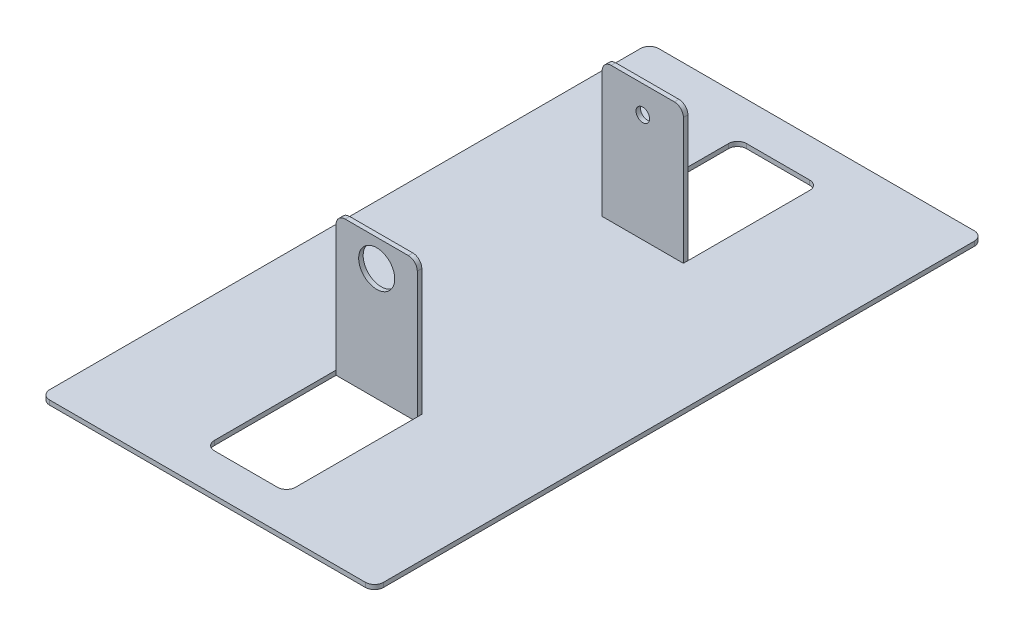
ISO-10303-21;
HEADER;
FILE_DESCRIPTION(('STEP AP214'),'2;1');
FILE_NAME('part.step','',(''),(''),'','','');
FILE_SCHEMA(('AUTOMOTIVE_DESIGN { 1 0 10303 214 1 1 1 1 }'));
ENDSEC;
DATA;
#1=APPLICATION_CONTEXT('core data for automotive mechanical design processes');
#2=APPLICATION_PROTOCOL_DEFINITION('international standard','automotive_design',2000,#1);
#3=PRODUCT_CONTEXT('',#1,'mechanical');
#4=PRODUCT('Part','Part','',(#3));
#5=PRODUCT_RELATED_PRODUCT_CATEGORY('part','',(#4));
#6=PRODUCT_DEFINITION_FORMATION('','',#4);
#7=PRODUCT_DEFINITION_CONTEXT('part definition',#1,'design');
#8=PRODUCT_DEFINITION('design','',#6,#7);
#9=PRODUCT_DEFINITION_SHAPE('','',#8);
#10=(LENGTH_UNIT() NAMED_UNIT(*) SI_UNIT(.MILLI.,.METRE.));
#11=(NAMED_UNIT(*) PLANE_ANGLE_UNIT() SI_UNIT($,.RADIAN.));
#12=(NAMED_UNIT(*) SI_UNIT($,.STERADIAN.) SOLID_ANGLE_UNIT());
#13=UNCERTAINTY_MEASURE_WITH_UNIT(LENGTH_MEASURE(1.E-05),#10,'distance_accuracy_value','');
#14=(GEOMETRIC_REPRESENTATION_CONTEXT(3) GLOBAL_UNCERTAINTY_ASSIGNED_CONTEXT((#13)) GLOBAL_UNIT_ASSIGNED_CONTEXT((#10,
#11,#12)) REPRESENTATION_CONTEXT('',''));
#15=CARTESIAN_POINT('',(0.,0.,0.));
#16=DIRECTION('',(0.,0.,1.));
#17=DIRECTION('',(1.,0.,0.));
#18=AXIS2_PLACEMENT_3D('',#15,#16,#17);
#19=CARTESIAN_POINT('',(-9.00000000000001,1.,29.));
#20=DIRECTION('',(1.,0.,0.));
#21=DIRECTION('',(0.,0.,-1.));
#22=AXIS2_PLACEMENT_3D('',#19,#20,#21);
#23=PLANE('',#22);
#24=DIRECTION('',(0.,0.,1.));
#25=VECTOR('',#24,1.);
#26=CARTESIAN_POINT('',(-9.00000000000001,1.,29.));
#27=LINE('',#26,#25);
#28=CARTESIAN_POINT('',(-9.00000000000001,1.,30.));
#29=VERTEX_POINT('',#28);
#30=CARTESIAN_POINT('',(-9.00000000000001,1.,57.));
#31=VERTEX_POINT('',#30);
#32=EDGE_CURVE('E272',#29,#31,#27,.T.);
#33=ORIENTED_EDGE('',*,*,#32,.T.);
#34=DIRECTION('',(0.,-1.,0.));
#35=VECTOR('',#34,1.);
#36=CARTESIAN_POINT('',(-9.00000000000001,0.,57.));
#37=LINE('',#36,#35);
#38=CARTESIAN_POINT('',(-9.00000000000001,0.,57.));
#39=VERTEX_POINT('',#38);
#40=EDGE_CURVE('E258',#31,#39,#37,.T.);
#41=ORIENTED_EDGE('',*,*,#40,.T.);
#42=DIRECTION('',(0.,0.,1.));
#43=VECTOR('',#42,1.);
#44=CARTESIAN_POINT('',(-9.00000000000001,0.,29.));
#45=LINE('',#44,#43);
#46=CARTESIAN_POINT('',(-9.00000000000001,0.,30.));
#47=VERTEX_POINT('',#46);
#48=EDGE_CURVE('E250',#47,#39,#45,.T.);
#49=ORIENTED_EDGE('',*,*,#48,.F.);
#50=DIRECTION('',(0.,-1.,0.));
#51=VECTOR('',#50,1.);
#52=CARTESIAN_POINT('',(-9.00000000000001,31.,30.));
#53=LINE('',#52,#51);
#54=EDGE_CURVE('E230',#29,#47,#53,.T.);
#55=ORIENTED_EDGE('',*,*,#54,.F.);
#56=EDGE_LOOP('',(#33,#41,#49,#55));
#57=FACE_BOUND('',#56,.T.);
#58=ADVANCED_FACE('F32',(#57),#23,.T.);
#59=CARTESIAN_POINT('',(8.99999999999999,1.,29.));
#60=DIRECTION('',(-1.,0.,0.));
#61=DIRECTION('',(0.,0.,1.));
#62=AXIS2_PLACEMENT_3D('',#59,#60,#61);
#63=PLANE('',#62);
#64=DIRECTION('',(0.,0.,-1.));
#65=VECTOR('',#64,1.);
#66=CARTESIAN_POINT('',(8.99999999999999,0.,29.));
#67=LINE('',#66,#65);
#68=CARTESIAN_POINT('',(8.99999999999999,0.,57.));
#69=VERTEX_POINT('',#68);
#70=CARTESIAN_POINT('',(8.99999999999999,0.,30.));
#71=VERTEX_POINT('',#70);
#72=EDGE_CURVE('E252',#69,#71,#67,.T.);
#73=ORIENTED_EDGE('',*,*,#72,.F.);
#74=DIRECTION('',(0.,-1.,0.));
#75=VECTOR('',#74,1.);
#76=CARTESIAN_POINT('',(8.99999999999999,1.,57.));
#77=LINE('',#76,#75);
#78=CARTESIAN_POINT('',(8.99999999999999,1.,57.));
#79=VERTEX_POINT('',#78);
#80=EDGE_CURVE('E320',#69,#79,#77,.F.);
#81=ORIENTED_EDGE('',*,*,#80,.T.);
#82=DIRECTION('',(0.,0.,-1.));
#83=VECTOR('',#82,1.);
#84=CARTESIAN_POINT('',(8.99999999999999,1.,29.));
#85=LINE('',#84,#83);
#86=CARTESIAN_POINT('',(8.99999999999999,1.,30.));
#87=VERTEX_POINT('',#86);
#88=EDGE_CURVE('E463',#79,#87,#85,.T.);
#89=ORIENTED_EDGE('',*,*,#88,.T.);
#90=DIRECTION('',(0.,-1.,0.));
#91=VECTOR('',#90,1.);
#92=CARTESIAN_POINT('',(8.99999999999999,31.,30.));
#93=LINE('',#92,#91);
#94=EDGE_CURVE('E882',#87,#71,#93,.T.);
#95=ORIENTED_EDGE('',*,*,#94,.T.);
#96=EDGE_LOOP('',(#73,#81,#89,#95));
#97=FACE_BOUND('',#96,.T.);
#98=ADVANCED_FACE('F534',(#97),#63,.T.);
#99=CARTESIAN_POINT('',(8.99999999999999,1.,-29.));
#100=DIRECTION('',(-1.,0.,0.));
#101=DIRECTION('',(0.,0.,1.));
#102=AXIS2_PLACEMENT_3D('',#99,#100,#101);
#103=PLANE('',#102);
#104=DIRECTION('',(0.,0.,-1.));
#105=VECTOR('',#104,1.);
#106=CARTESIAN_POINT('',(8.99999999999999,1.,-29.));
#107=LINE('',#106,#105);
#108=CARTESIAN_POINT('',(8.99999999999999,1.,-30.));
#109=VERTEX_POINT('',#108);
#110=CARTESIAN_POINT('',(8.99999999999999,1.,-57.));
#111=VERTEX_POINT('',#110);
#112=EDGE_CURVE('E277',#109,#111,#107,.T.);
#113=ORIENTED_EDGE('',*,*,#112,.T.);
#114=DIRECTION('',(0.,-1.,0.));
#115=VECTOR('',#114,1.);
#116=CARTESIAN_POINT('',(8.99999999999999,0.,-57.));
#117=LINE('',#116,#115);
#118=CARTESIAN_POINT('',(8.99999999999999,0.,-57.));
#119=VERTEX_POINT('',#118);
#120=EDGE_CURVE('E358',#111,#119,#117,.T.);
#121=ORIENTED_EDGE('',*,*,#120,.T.);
#122=DIRECTION('',(0.,0.,-1.));
#123=VECTOR('',#122,1.);
#124=CARTESIAN_POINT('',(8.99999999999999,0.,-29.));
#125=LINE('',#124,#123);
#126=CARTESIAN_POINT('',(8.99999999999999,0.,-30.));
#127=VERTEX_POINT('',#126);
#128=EDGE_CURVE('E286',#127,#119,#125,.T.);
#129=ORIENTED_EDGE('',*,*,#128,.F.);
#130=DIRECTION('',(0.,-1.,0.));
#131=VECTOR('',#130,1.);
#132=CARTESIAN_POINT('',(8.99999999999999,31.,-30.));
#133=LINE('',#132,#131);
#134=EDGE_CURVE('E447',#109,#127,#133,.T.);
#135=ORIENTED_EDGE('',*,*,#134,.F.);
#136=EDGE_LOOP('',(#113,#121,#129,#135));
#137=FACE_BOUND('',#136,.T.);
#138=ADVANCED_FACE('F445',(#137),#103,.T.);
#139=CARTESIAN_POINT('',(-9.00000000000001,1.,-29.));
#140=DIRECTION('',(1.,0.,0.));
#141=DIRECTION('',(0.,0.,-1.));
#142=AXIS2_PLACEMENT_3D('',#139,#140,#141);
#143=PLANE('',#142);
#144=DIRECTION('',(0.,0.,1.));
#145=VECTOR('',#144,1.);
#146=CARTESIAN_POINT('',(-9.00000000000001,0.,-29.));
#147=LINE('',#146,#145);
#148=CARTESIAN_POINT('',(-9.00000000000001,0.,-57.));
#149=VERTEX_POINT('',#148);
#150=CARTESIAN_POINT('',(-9.00000000000001,0.,-30.));
#151=VERTEX_POINT('',#150);
#152=EDGE_CURVE('E292',#149,#151,#147,.T.);
#153=ORIENTED_EDGE('',*,*,#152,.F.);
#154=DIRECTION('',(0.,-1.,0.));
#155=VECTOR('',#154,1.);
#156=CARTESIAN_POINT('',(-9.00000000000001,1.,-57.));
#157=LINE('',#156,#155);
#158=CARTESIAN_POINT('',(-9.00000000000001,1.,-57.));
#159=VERTEX_POINT('',#158);
#160=EDGE_CURVE('E366',#149,#159,#157,.F.);
#161=ORIENTED_EDGE('',*,*,#160,.T.);
#162=DIRECTION('',(0.,0.,1.));
#163=VECTOR('',#162,1.);
#164=CARTESIAN_POINT('',(-9.00000000000001,1.,-29.));
#165=LINE('',#164,#163);
#166=CARTESIAN_POINT('',(-9.00000000000001,1.,-30.));
#167=VERTEX_POINT('',#166);
#168=EDGE_CURVE('E280',#159,#167,#165,.T.);
#169=ORIENTED_EDGE('',*,*,#168,.T.);
#170=DIRECTION('',(0.,-1.,0.));
#171=VECTOR('',#170,1.);
#172=CARTESIAN_POINT('',(-9.00000000000001,31.,-30.));
#173=LINE('',#172,#171);
#174=EDGE_CURVE('E426',#167,#151,#173,.T.);
#175=ORIENTED_EDGE('',*,*,#174,.T.);
#176=EDGE_LOOP('',(#153,#161,#169,#175));
#177=FACE_BOUND('',#176,.T.);
#178=ADVANCED_FACE('F423',(#177),#143,.T.);
#179=CARTESIAN_POINT('',(0.,1.,0.));
#180=DIRECTION('',(0.,-1.,0.));
#181=DIRECTION('',(0.,0.,-1.));
#182=AXIS2_PLACEMENT_3D('',#179,#180,#181);
#183=PLANE('',#182);
#184=CARTESIAN_POINT('',(8.99999999999999,1.,-29.));
#185=VERTEX_POINT('',#184);
#186=EDGE_CURVE('E273',#185,#109,#107,.T.);
#187=ORIENTED_EDGE('',*,*,#186,.F.);
#188=DIRECTION('',(1.,0.,0.));
#189=VECTOR('',#188,1.);
#190=CARTESIAN_POINT('',(-9.00000000000001,1.,-29.));
#191=LINE('',#190,#189);
#192=CARTESIAN_POINT('',(-9.00000000000001,1.,-29.));
#193=VERTEX_POINT('',#192);
#194=EDGE_CURVE('E282',#193,#185,#191,.T.);
#195=ORIENTED_EDGE('',*,*,#194,.F.);
#196=DIRECTION('',(0.,0.,1.));
#197=VECTOR('',#196,1.);
#198=CARTESIAN_POINT('',(-9.00000000000001,1.,0.));
#199=LINE('',#198,#197);
#200=EDGE_CURVE('E260',#167,#193,#199,.T.);
#201=ORIENTED_EDGE('',*,*,#200,.F.);
#202=ORIENTED_EDGE('',*,*,#168,.F.);
#203=CARTESIAN_POINT('',(-7.00000000000001,1.,-57.));
#204=DIRECTION('',(0.,-1.,0.));
#205=DIRECTION('',(0.,0.,-1.));
#206=AXIS2_PLACEMENT_3D('',#203,#204,#205);
#207=CIRCLE('',#206,2.);
#208=CARTESIAN_POINT('',(-7.00000000000001,1.,-59.));
#209=VERTEX_POINT('',#208);
#210=EDGE_CURVE('E11',#159,#209,#207,.T.);
#211=ORIENTED_EDGE('',*,*,#210,.T.);
#212=DIRECTION('',(-1.,0.,0.));
#213=VECTOR('',#212,1.);
#214=CARTESIAN_POINT('',(-9.00000000000001,1.,-59.));
#215=LINE('',#214,#213);
#216=CARTESIAN_POINT('',(6.99999999999999,1.,-59.));
#217=VERTEX_POINT('',#216);
#218=EDGE_CURVE('E276',#217,#209,#215,.T.);
#219=ORIENTED_EDGE('',*,*,#218,.F.);
#220=CARTESIAN_POINT('',(6.99999999999999,1.,-57.));
#221=DIRECTION('',(0.,-1.,0.));
#222=DIRECTION('',(0.,0.,-1.));
#223=AXIS2_PLACEMENT_3D('',#220,#221,#222);
#224=CIRCLE('',#223,2.);
#225=EDGE_CURVE('E412',#217,#111,#224,.T.);
#226=ORIENTED_EDGE('',*,*,#225,.T.);
#227=ORIENTED_EDGE('',*,*,#112,.F.);
#228=EDGE_LOOP('',(#187,#195,#201,#202,#211,#219,#226,#227));
#229=FACE_BOUND('',#228,.T.);
#230=DIRECTION('',(-1.,0.,0.));
#231=VECTOR('',#230,1.);
#232=CARTESIAN_POINT('',(-37.,1.,-67.5));
#233=LINE('',#232,#231);
#234=CARTESIAN_POINT('',(35.,1.,-67.5));
#235=VERTEX_POINT('',#234);
#236=CARTESIAN_POINT('',(-35.,1.,-67.5));
#237=VERTEX_POINT('',#236);
#238=EDGE_CURVE('E297',#235,#237,#233,.T.);
#239=ORIENTED_EDGE('',*,*,#238,.T.);
#240=CARTESIAN_POINT('',(-35.,1.,-65.5));
#241=DIRECTION('',(0.,-1.,0.));
#242=DIRECTION('',(0.,0.,-1.));
#243=AXIS2_PLACEMENT_3D('',#240,#241,#242);
#244=CIRCLE('',#243,2.);
#245=CARTESIAN_POINT('',(-37.,1.,-65.5));
#246=VERTEX_POINT('',#245);
#247=EDGE_CURVE('E391',#237,#246,#244,.F.);
#248=ORIENTED_EDGE('',*,*,#247,.T.);
#249=DIRECTION('',(0.,0.,1.));
#250=VECTOR('',#249,1.);
#251=CARTESIAN_POINT('',(-37.,1.,67.5));
#252=LINE('',#251,#250);
#253=CARTESIAN_POINT('',(-37.,1.,65.5));
#254=VERTEX_POINT('',#253);
#255=EDGE_CURVE('E301',#246,#254,#252,.T.);
#256=ORIENTED_EDGE('',*,*,#255,.T.);
#257=CARTESIAN_POINT('',(-35.,1.,65.5));
#258=DIRECTION('',(0.,-1.,0.));
#259=DIRECTION('',(0.,0.,-1.));
#260=AXIS2_PLACEMENT_3D('',#257,#258,#259);
#261=CIRCLE('',#260,2.);
#262=CARTESIAN_POINT('',(-35.,1.,67.5));
#263=VERTEX_POINT('',#262);
#264=EDGE_CURVE('E54',#254,#263,#261,.F.);
#265=ORIENTED_EDGE('',*,*,#264,.T.);
#266=DIRECTION('',(1.,0.,0.));
#267=VECTOR('',#266,1.);
#268=CARTESIAN_POINT('',(-37.,1.,67.5));
#269=LINE('',#268,#267);
#270=CARTESIAN_POINT('',(35.,1.,67.5));
#271=VERTEX_POINT('',#270);
#272=EDGE_CURVE('E303',#263,#271,#269,.T.);
#273=ORIENTED_EDGE('',*,*,#272,.T.);
#274=CARTESIAN_POINT('',(35.,1.,65.5));
#275=DIRECTION('',(0.,-1.,0.));
#276=DIRECTION('',(0.,0.,-1.));
#277=AXIS2_PLACEMENT_3D('',#274,#275,#276);
#278=CIRCLE('',#277,2.);
#279=CARTESIAN_POINT('',(37.,1.,65.5));
#280=VERTEX_POINT('',#279);
#281=EDGE_CURVE('E387',#271,#280,#278,.F.);
#282=ORIENTED_EDGE('',*,*,#281,.T.);
#283=DIRECTION('',(0.,0.,-1.));
#284=VECTOR('',#283,1.);
#285=CARTESIAN_POINT('',(37.,1.,67.5));
#286=LINE('',#285,#284);
#287=CARTESIAN_POINT('',(37.,1.,-65.5));
#288=VERTEX_POINT('',#287);
#289=EDGE_CURVE('E294',#280,#288,#286,.T.);
#290=ORIENTED_EDGE('',*,*,#289,.T.);
#291=CARTESIAN_POINT('',(35.,1.,-65.5));
#292=DIRECTION('',(0.,-1.,0.));
#293=DIRECTION('',(0.,0.,-1.));
#294=AXIS2_PLACEMENT_3D('',#291,#292,#293);
#295=CIRCLE('',#294,2.);
#296=EDGE_CURVE('E389',#288,#235,#295,.F.);
#297=ORIENTED_EDGE('',*,*,#296,.T.);
#298=EDGE_LOOP('',(#239,#248,#256,#265,#273,#282,#290,#297));
#299=FACE_BOUND('',#298,.T.);
#300=CARTESIAN_POINT('',(-9.00000000000001,1.,29.));
#301=VERTEX_POINT('',#300);
#302=EDGE_CURVE('E459',#301,#29,#27,.T.);
#303=ORIENTED_EDGE('',*,*,#302,.F.);
#304=DIRECTION('',(-1.,0.,0.));
#305=VECTOR('',#304,1.);
#306=CARTESIAN_POINT('',(-9.00000000000001,1.,29.));
#307=LINE('',#306,#305);
#308=CARTESIAN_POINT('',(8.99999999999999,1.,29.));
#309=VERTEX_POINT('',#308);
#310=EDGE_CURVE('E268',#309,#301,#307,.T.);
#311=ORIENTED_EDGE('',*,*,#310,.F.);
#312=DIRECTION('',(0.,0.,-1.));
#313=VECTOR('',#312,1.);
#314=CARTESIAN_POINT('',(8.99999999999999,1.,0.));
#315=LINE('',#314,#313);
#316=EDGE_CURVE('E483',#87,#309,#315,.T.);
#317=ORIENTED_EDGE('',*,*,#316,.F.);
#318=ORIENTED_EDGE('',*,*,#88,.F.);
#319=CARTESIAN_POINT('',(6.99999999999999,1.,57.));
#320=DIRECTION('',(0.,-1.,0.));
#321=DIRECTION('',(0.,0.,-1.));
#322=AXIS2_PLACEMENT_3D('',#319,#320,#321);
#323=CIRCLE('',#322,2.);
#324=CARTESIAN_POINT('',(6.99999999999999,1.,59.));
#325=VERTEX_POINT('',#324);
#326=EDGE_CURVE('E408',#79,#325,#323,.T.);
#327=ORIENTED_EDGE('',*,*,#326,.T.);
#328=DIRECTION('',(1.,0.,0.));
#329=VECTOR('',#328,1.);
#330=CARTESIAN_POINT('',(-9.00000000000001,1.,59.));
#331=LINE('',#330,#329);
#332=CARTESIAN_POINT('',(-7.00000000000001,1.,59.));
#333=VERTEX_POINT('',#332);
#334=EDGE_CURVE('E461',#333,#325,#331,.T.);
#335=ORIENTED_EDGE('',*,*,#334,.F.);
#336=CARTESIAN_POINT('',(-7.00000000000001,1.,57.));
#337=DIRECTION('',(0.,-1.,0.));
#338=DIRECTION('',(0.,0.,-1.));
#339=AXIS2_PLACEMENT_3D('',#336,#337,#338);
#340=CIRCLE('',#339,2.);
#341=EDGE_CURVE('E404',#333,#31,#340,.T.);
#342=ORIENTED_EDGE('',*,*,#341,.T.);
#343=ORIENTED_EDGE('',*,*,#32,.F.);
#344=EDGE_LOOP('',(#303,#311,#317,#318,#327,#335,#342,#343));
#345=FACE_BOUND('',#344,.T.);
#346=ADVANCED_FACE('F432',(#229,#299,#345),#183,.F.);
#347=CARTESIAN_POINT('',(0.,0.,0.));
#348=DIRECTION('',(0.,-1.,0.));
#349=DIRECTION('',(0.,0.,-1.));
#350=AXIS2_PLACEMENT_3D('',#347,#348,#349);
#351=PLANE('',#350);
#352=DIRECTION('',(1.,0.,0.));
#353=VECTOR('',#352,1.);
#354=CARTESIAN_POINT('',(-9.00000000000001,0.,30.));
#355=LINE('',#354,#353);
#356=EDGE_CURVE('E235',#47,#71,#355,.T.);
#357=ORIENTED_EDGE('',*,*,#356,.F.);
#358=ORIENTED_EDGE('',*,*,#48,.T.);
#359=CARTESIAN_POINT('',(-7.00000000000001,0.,57.));
#360=DIRECTION('',(0.,-1.,0.));
#361=DIRECTION('',(0.,0.,-1.));
#362=AXIS2_PLACEMENT_3D('',#359,#360,#361);
#363=CIRCLE('',#362,2.);
#364=CARTESIAN_POINT('',(-7.00000000000001,0.,59.));
#365=VERTEX_POINT('',#364);
#366=EDGE_CURVE('E402',#39,#365,#363,.F.);
#367=ORIENTED_EDGE('',*,*,#366,.T.);
#368=DIRECTION('',(1.,0.,0.));
#369=VECTOR('',#368,1.);
#370=CARTESIAN_POINT('',(-9.00000000000001,0.,59.));
#371=LINE('',#370,#369);
#372=CARTESIAN_POINT('',(6.99999999999999,0.,59.));
#373=VERTEX_POINT('',#372);
#374=EDGE_CURVE('E259',#365,#373,#371,.T.);
#375=ORIENTED_EDGE('',*,*,#374,.T.);
#376=CARTESIAN_POINT('',(6.99999999999999,0.,57.));
#377=DIRECTION('',(0.,-1.,0.));
#378=DIRECTION('',(0.,0.,-1.));
#379=AXIS2_PLACEMENT_3D('',#376,#377,#378);
#380=CIRCLE('',#379,2.);
#381=EDGE_CURVE('E406',#373,#69,#380,.F.);
#382=ORIENTED_EDGE('',*,*,#381,.T.);
#383=ORIENTED_EDGE('',*,*,#72,.T.);
#384=EDGE_LOOP('',(#357,#358,#367,#375,#382,#383));
#385=FACE_BOUND('',#384,.T.);
#386=DIRECTION('',(-1.,0.,0.));
#387=VECTOR('',#386,1.);
#388=CARTESIAN_POINT('',(-9.00000000000001,0.,-30.));
#389=LINE('',#388,#387);
#390=EDGE_CURVE('E485',#127,#151,#389,.T.);
#391=ORIENTED_EDGE('',*,*,#390,.F.);
#392=ORIENTED_EDGE('',*,*,#128,.T.);
#393=CARTESIAN_POINT('',(6.99999999999999,0.,-57.));
#394=DIRECTION('',(0.,-1.,0.));
#395=DIRECTION('',(0.,0.,-1.));
#396=AXIS2_PLACEMENT_3D('',#393,#394,#395);
#397=CIRCLE('',#396,2.);
#398=CARTESIAN_POINT('',(6.99999999999999,0.,-59.));
#399=VERTEX_POINT('',#398);
#400=EDGE_CURVE('E410',#119,#399,#397,.F.);
#401=ORIENTED_EDGE('',*,*,#400,.T.);
#402=DIRECTION('',(-1.,0.,0.));
#403=VECTOR('',#402,1.);
#404=CARTESIAN_POINT('',(-9.00000000000001,0.,-59.));
#405=LINE('',#404,#403);
#406=CARTESIAN_POINT('',(-7.00000000000001,0.,-59.));
#407=VERTEX_POINT('',#406);
#408=EDGE_CURVE('E289',#399,#407,#405,.T.);
#409=ORIENTED_EDGE('',*,*,#408,.T.);
#410=CARTESIAN_POINT('',(-7.00000000000001,0.,-57.));
#411=DIRECTION('',(0.,-1.,0.));
#412=DIRECTION('',(0.,0.,-1.));
#413=AXIS2_PLACEMENT_3D('',#410,#411,#412);
#414=CIRCLE('',#413,2.);
#415=EDGE_CURVE('E40',#407,#149,#414,.F.);
#416=ORIENTED_EDGE('',*,*,#415,.T.);
#417=ORIENTED_EDGE('',*,*,#152,.T.);
#418=EDGE_LOOP('',(#391,#392,#401,#409,#416,#417));
#419=FACE_BOUND('',#418,.T.);
#420=DIRECTION('',(0.,0.,1.));
#421=VECTOR('',#420,1.);
#422=CARTESIAN_POINT('',(-37.,0.,67.5));
#423=LINE('',#422,#421);
#424=CARTESIAN_POINT('',(-37.,0.,-65.5));
#425=VERTEX_POINT('',#424);
#426=CARTESIAN_POINT('',(-37.,0.,65.5));
#427=VERTEX_POINT('',#426);
#428=EDGE_CURVE('E310',#425,#427,#423,.T.);
#429=ORIENTED_EDGE('',*,*,#428,.F.);
#430=CARTESIAN_POINT('',(-35.,0.,-65.5));
#431=DIRECTION('',(0.,-1.,0.));
#432=DIRECTION('',(0.,0.,-1.));
#433=AXIS2_PLACEMENT_3D('',#430,#431,#432);
#434=CIRCLE('',#433,2.);
#435=CARTESIAN_POINT('',(-35.,0.,-67.5));
#436=VERTEX_POINT('',#435);
#437=EDGE_CURVE('E379',#425,#436,#434,.T.);
#438=ORIENTED_EDGE('',*,*,#437,.T.);
#439=DIRECTION('',(-1.,0.,0.));
#440=VECTOR('',#439,1.);
#441=CARTESIAN_POINT('',(-37.,0.,-67.5));
#442=LINE('',#441,#440);
#443=CARTESIAN_POINT('',(35.,0.,-67.5));
#444=VERTEX_POINT('',#443);
#445=EDGE_CURVE('E307',#444,#436,#442,.T.);
#446=ORIENTED_EDGE('',*,*,#445,.F.);
#447=CARTESIAN_POINT('',(35.,0.,-65.5));
#448=DIRECTION('',(0.,-1.,0.));
#449=DIRECTION('',(0.,0.,-1.));
#450=AXIS2_PLACEMENT_3D('',#447,#448,#449);
#451=CIRCLE('',#450,2.);
#452=CARTESIAN_POINT('',(37.,0.,-65.5));
#453=VERTEX_POINT('',#452);
#454=EDGE_CURVE('E377',#444,#453,#451,.T.);
#455=ORIENTED_EDGE('',*,*,#454,.T.);
#456=DIRECTION('',(0.,0.,-1.));
#457=VECTOR('',#456,1.);
#458=CARTESIAN_POINT('',(37.,0.,67.5));
#459=LINE('',#458,#457);
#460=CARTESIAN_POINT('',(37.,0.,65.5));
#461=VERTEX_POINT('',#460);
#462=EDGE_CURVE('E285',#461,#453,#459,.T.);
#463=ORIENTED_EDGE('',*,*,#462,.F.);
#464=CARTESIAN_POINT('',(35.,0.,65.5));
#465=DIRECTION('',(0.,-1.,0.));
#466=DIRECTION('',(0.,0.,-1.));
#467=AXIS2_PLACEMENT_3D('',#464,#465,#466);
#468=CIRCLE('',#467,2.);
#469=CARTESIAN_POINT('',(35.,0.,67.5));
#470=VERTEX_POINT('',#469);
#471=EDGE_CURVE('E375',#461,#470,#468,.T.);
#472=ORIENTED_EDGE('',*,*,#471,.T.);
#473=DIRECTION('',(1.,0.,0.));
#474=VECTOR('',#473,1.);
#475=CARTESIAN_POINT('',(-37.,0.,67.5));
#476=LINE('',#475,#474);
#477=CARTESIAN_POINT('',(-35.,0.,67.5));
#478=VERTEX_POINT('',#477);
#479=EDGE_CURVE('E298',#478,#470,#476,.T.);
#480=ORIENTED_EDGE('',*,*,#479,.F.);
#481=CARTESIAN_POINT('',(-35.,0.,65.5));
#482=DIRECTION('',(0.,-1.,0.));
#483=DIRECTION('',(0.,0.,-1.));
#484=AXIS2_PLACEMENT_3D('',#481,#482,#483);
#485=CIRCLE('',#484,2.);
#486=EDGE_CURVE('E373',#478,#427,#485,.T.);
#487=ORIENTED_EDGE('',*,*,#486,.T.);
#488=EDGE_LOOP('',(#429,#438,#446,#455,#463,#472,#480,#487));
#489=FACE_BOUND('',#488,.T.);
#490=ADVANCED_FACE('F248',(#385,#419,#489),#351,.T.);
#491=CARTESIAN_POINT('',(37.,1.,67.5));
#492=DIRECTION('',(-1.,0.,0.));
#493=DIRECTION('',(0.,0.,1.));
#494=AXIS2_PLACEMENT_3D('',#491,#492,#493);
#495=PLANE('',#494);
#496=ORIENTED_EDGE('',*,*,#462,.T.);
#497=DIRECTION('',(0.,-1.,0.));
#498=VECTOR('',#497,1.);
#499=CARTESIAN_POINT('',(37.,1.,-65.5));
#500=LINE('',#499,#498);
#501=EDGE_CURVE('E396',#453,#288,#500,.F.);
#502=ORIENTED_EDGE('',*,*,#501,.T.);
#503=ORIENTED_EDGE('',*,*,#289,.F.);
#504=DIRECTION('',(0.,-1.,0.));
#505=VECTOR('',#504,1.);
#506=CARTESIAN_POINT('',(37.,1.,65.5));
#507=LINE('',#506,#505);
#508=EDGE_CURVE('E393',#280,#461,#507,.T.);
#509=ORIENTED_EDGE('',*,*,#508,.T.);
#510=EDGE_LOOP('',(#496,#502,#503,#509));
#511=FACE_BOUND('',#510,.T.);
#512=ADVANCED_FACE('F552',(#511),#495,.F.);
#513=CARTESIAN_POINT('',(-37.,1.,-67.5));
#514=DIRECTION('',(0.,0.,1.));
#515=DIRECTION('',(1.,0.,0.));
#516=AXIS2_PLACEMENT_3D('',#513,#514,#515);
#517=PLANE('',#516);
#518=ORIENTED_EDGE('',*,*,#445,.T.);
#519=DIRECTION('',(0.,-1.,0.));
#520=VECTOR('',#519,1.);
#521=CARTESIAN_POINT('',(-35.,1.,-67.5));
#522=LINE('',#521,#520);
#523=EDGE_CURVE('E384',#436,#237,#522,.F.);
#524=ORIENTED_EDGE('',*,*,#523,.T.);
#525=ORIENTED_EDGE('',*,*,#238,.F.);
#526=DIRECTION('',(0.,-1.,0.));
#527=VECTOR('',#526,1.);
#528=CARTESIAN_POINT('',(35.,1.,-67.5));
#529=LINE('',#528,#527);
#530=EDGE_CURVE('E381',#235,#444,#529,.T.);
#531=ORIENTED_EDGE('',*,*,#530,.T.);
#532=EDGE_LOOP('',(#518,#524,#525,#531));
#533=FACE_BOUND('',#532,.T.);
#534=ADVANCED_FACE('F558',(#533),#517,.F.);
#535=CARTESIAN_POINT('',(-37.,1.,67.5));
#536=DIRECTION('',(1.,0.,0.));
#537=DIRECTION('',(0.,0.,-1.));
#538=AXIS2_PLACEMENT_3D('',#535,#536,#537);
#539=PLANE('',#538);
#540=ORIENTED_EDGE('',*,*,#255,.F.);
#541=DIRECTION('',(0.,-1.,0.));
#542=VECTOR('',#541,1.);
#543=CARTESIAN_POINT('',(-37.,1.,-65.5));
#544=LINE('',#543,#542);
#545=EDGE_CURVE('E370',#246,#425,#544,.T.);
#546=ORIENTED_EDGE('',*,*,#545,.T.);
#547=ORIENTED_EDGE('',*,*,#428,.T.);
#548=DIRECTION('',(0.,-1.,0.));
#549=VECTOR('',#548,1.);
#550=CARTESIAN_POINT('',(-37.,1.,65.5));
#551=LINE('',#550,#549);
#552=EDGE_CURVE('E368',#427,#254,#551,.F.);
#553=ORIENTED_EDGE('',*,*,#552,.T.);
#554=EDGE_LOOP('',(#540,#546,#547,#553));
#555=FACE_BOUND('',#554,.T.);
#556=ADVANCED_FACE('F555',(#555),#539,.F.);
#557=CARTESIAN_POINT('',(-37.,1.,67.5));
#558=DIRECTION('',(0.,0.,-1.));
#559=DIRECTION('',(-1.,0.,0.));
#560=AXIS2_PLACEMENT_3D('',#557,#558,#559);
#561=PLANE('',#560);
#562=ORIENTED_EDGE('',*,*,#479,.T.);
#563=DIRECTION('',(0.,-1.,0.));
#564=VECTOR('',#563,1.);
#565=CARTESIAN_POINT('',(35.,1.,67.5));
#566=LINE('',#565,#564);
#567=EDGE_CURVE('E47',#470,#271,#566,.F.);
#568=ORIENTED_EDGE('',*,*,#567,.T.);
#569=ORIENTED_EDGE('',*,*,#272,.F.);
#570=DIRECTION('',(0.,-1.,0.));
#571=VECTOR('',#570,1.);
#572=CARTESIAN_POINT('',(-35.,1.,67.5));
#573=LINE('',#572,#571);
#574=EDGE_CURVE('E398',#263,#478,#573,.T.);
#575=ORIENTED_EDGE('',*,*,#574,.T.);
#576=EDGE_LOOP('',(#562,#568,#569,#575));
#577=FACE_BOUND('',#576,.T.);
#578=ADVANCED_FACE('F545',(#577),#561,.F.);
#579=CARTESIAN_POINT('',(-9.00000000000001,1.,-59.));
#580=DIRECTION('',(0.,0.,1.));
#581=DIRECTION('',(1.,0.,0.));
#582=AXIS2_PLACEMENT_3D('',#579,#580,#581);
#583=PLANE('',#582);
#584=ORIENTED_EDGE('',*,*,#408,.F.);
#585=DIRECTION('',(0.,-1.,0.));
#586=VECTOR('',#585,1.);
#587=CARTESIAN_POINT('',(6.99999999999999,1.,-59.));
#588=LINE('',#587,#586);
#589=EDGE_CURVE('E364',#399,#217,#588,.F.);
#590=ORIENTED_EDGE('',*,*,#589,.T.);
#591=ORIENTED_EDGE('',*,*,#218,.T.);
#592=DIRECTION('',(0.,-1.,0.));
#593=VECTOR('',#592,1.);
#594=CARTESIAN_POINT('',(-7.00000000000001,0.,-59.));
#595=LINE('',#594,#593);
#596=EDGE_CURVE('E361',#209,#407,#595,.T.);
#597=ORIENTED_EDGE('',*,*,#596,.T.);
#598=EDGE_LOOP('',(#584,#590,#591,#597));
#599=FACE_BOUND('',#598,.T.);
#600=ADVANCED_FACE('F436',(#599),#583,.T.);
#601=CARTESIAN_POINT('',(-9.00000000000001,1.,59.));
#602=DIRECTION('',(0.,0.,-1.));
#603=DIRECTION('',(-1.,0.,0.));
#604=AXIS2_PLACEMENT_3D('',#601,#602,#603);
#605=PLANE('',#604);
#606=ORIENTED_EDGE('',*,*,#374,.F.);
#607=DIRECTION('',(0.,-1.,0.));
#608=VECTOR('',#607,1.);
#609=CARTESIAN_POINT('',(-7.00000000000001,1.,59.));
#610=LINE('',#609,#608);
#611=EDGE_CURVE('E318',#365,#333,#610,.F.);
#612=ORIENTED_EDGE('',*,*,#611,.T.);
#613=ORIENTED_EDGE('',*,*,#334,.T.);
#614=DIRECTION('',(0.,-1.,0.));
#615=VECTOR('',#614,1.);
#616=CARTESIAN_POINT('',(6.99999999999999,0.,59.));
#617=LINE('',#616,#615);
#618=EDGE_CURVE('E315',#325,#373,#617,.T.);
#619=ORIENTED_EDGE('',*,*,#618,.T.);
#620=EDGE_LOOP('',(#606,#612,#613,#619));
#621=FACE_BOUND('',#620,.T.);
#622=ADVANCED_FACE('F521',(#621),#605,.T.);
#623=CARTESIAN_POINT('',(-9.00000000000001,31.,-29.));
#624=DIRECTION('',(0.,0.,-1.));
#625=DIRECTION('',(-1.,0.,0.));
#626=AXIS2_PLACEMENT_3D('',#623,#624,#625);
#627=PLANE('',#626);
#628=CARTESIAN_POINT('',(0.,25.,-29.));
#629=DIRECTION('',(0.,0.,1.));
#630=DIRECTION('',(1.,0.,0.));
#631=AXIS2_PLACEMENT_3D('',#628,#629,#630);
#632=CIRCLE('',#631,1.5);
#633=CARTESIAN_POINT('',(1.5,25.,-29.));
#634=VERTEX_POINT('',#633);
#635=EDGE_CURVE('E873',#634,#634,#632,.T.);
#636=ORIENTED_EDGE('',*,*,#635,.F.);
#637=EDGE_LOOP('',(#636));
#638=FACE_BOUND('',#637,.T.);
#639=DIRECTION('',(0.,-1.,0.));
#640=VECTOR('',#639,1.);
#641=CARTESIAN_POINT('',(8.99999999999999,31.,-29.));
#642=LINE('',#641,#640);
#643=CARTESIAN_POINT('',(8.99999999999999,29.,-29.));
#644=VERTEX_POINT('',#643);
#645=EDGE_CURVE('E452',#644,#185,#642,.T.);
#646=ORIENTED_EDGE('',*,*,#645,.F.);
#647=CARTESIAN_POINT('',(6.99999999999999,29.,-29.));
#648=DIRECTION('',(0.,0.,-1.));
#649=DIRECTION('',(-1.,0.,0.));
#650=AXIS2_PLACEMENT_3D('',#647,#648,#649);
#651=CIRCLE('',#650,2.);
#652=CARTESIAN_POINT('',(6.99999999999999,31.,-29.));
#653=VERTEX_POINT('',#652);
#654=EDGE_CURVE('E354',#644,#653,#651,.F.);
#655=ORIENTED_EDGE('',*,*,#654,.T.);
#656=DIRECTION('',(1.,0.,0.));
#657=VECTOR('',#656,1.);
#658=CARTESIAN_POINT('',(-9.00000000000001,31.,-29.));
#659=LINE('',#658,#657);
#660=CARTESIAN_POINT('',(-7.00000000000001,31.,-29.));
#661=VERTEX_POINT('',#660);
#662=EDGE_CURVE('E489',#661,#653,#659,.T.);
#663=ORIENTED_EDGE('',*,*,#662,.F.);
#664=CARTESIAN_POINT('',(-7.00000000000001,29.,-29.));
#665=DIRECTION('',(0.,0.,-1.));
#666=DIRECTION('',(-1.,0.,0.));
#667=AXIS2_PLACEMENT_3D('',#664,#665,#666);
#668=CIRCLE('',#667,2.);
#669=CARTESIAN_POINT('',(-9.00000000000001,29.,-29.));
#670=VERTEX_POINT('',#669);
#671=EDGE_CURVE('E352',#661,#670,#668,.F.);
#672=ORIENTED_EDGE('',*,*,#671,.T.);
#673=DIRECTION('',(0.,-1.,0.));
#674=VECTOR('',#673,1.);
#675=CARTESIAN_POINT('',(-9.00000000000001,31.,-29.));
#676=LINE('',#675,#674);
#677=EDGE_CURVE('E265',#670,#193,#676,.T.);
#678=ORIENTED_EDGE('',*,*,#677,.T.);
#679=ORIENTED_EDGE('',*,*,#194,.T.);
#680=EDGE_LOOP('',(#646,#655,#663,#672,#678,#679));
#681=FACE_BOUND('',#680,.T.);
#682=ADVANCED_FACE('F519',(#638,#681),#627,.F.);
#683=CARTESIAN_POINT('',(-9.00000000000001,31.,-29.));
#684=DIRECTION('',(1.,0.,0.));
#685=DIRECTION('',(0.,0.,-1.));
#686=AXIS2_PLACEMENT_3D('',#683,#684,#685);
#687=PLANE('',#686);
#688=ORIENTED_EDGE('',*,*,#677,.F.);
#689=DIRECTION('',(0.,0.,1.));
#690=VECTOR('',#689,1.);
#691=CARTESIAN_POINT('',(-9.00000000000001,29.,-29.));
#692=LINE('',#691,#690);
#693=CARTESIAN_POINT('',(-9.00000000000001,29.,-30.));
#694=VERTEX_POINT('',#693);
#695=EDGE_CURVE('E356',#670,#694,#692,.F.);
#696=ORIENTED_EDGE('',*,*,#695,.T.);
#697=EDGE_CURVE('E450',#694,#167,#173,.T.);
#698=ORIENTED_EDGE('',*,*,#697,.T.);
#699=ORIENTED_EDGE('',*,*,#200,.T.);
#700=EDGE_LOOP('',(#688,#696,#698,#699));
#701=FACE_BOUND('',#700,.T.);
#702=ADVANCED_FACE('F501',(#701),#687,.F.);
#703=CARTESIAN_POINT('',(8.99999999999999,31.,-29.));
#704=DIRECTION('',(-1.,0.,0.));
#705=DIRECTION('',(0.,0.,1.));
#706=AXIS2_PLACEMENT_3D('',#703,#704,#705);
#707=PLANE('',#706);
#708=CARTESIAN_POINT('',(8.99999999999999,29.,-30.));
#709=VERTEX_POINT('',#708);
#710=EDGE_CURVE('E449',#709,#109,#133,.T.);
#711=ORIENTED_EDGE('',*,*,#710,.F.);
#712=DIRECTION('',(0.,0.,-1.));
#713=VECTOR('',#712,1.);
#714=CARTESIAN_POINT('',(8.99999999999999,29.,-29.));
#715=LINE('',#714,#713);
#716=EDGE_CURVE('E350',#709,#644,#715,.F.);
#717=ORIENTED_EDGE('',*,*,#716,.T.);
#718=ORIENTED_EDGE('',*,*,#645,.T.);
#719=ORIENTED_EDGE('',*,*,#186,.T.);
#720=EDGE_LOOP('',(#711,#717,#718,#719));
#721=FACE_BOUND('',#720,.T.);
#722=ADVANCED_FACE('F516',(#721),#707,.F.);
#723=CARTESIAN_POINT('',(-9.00000000000001,31.,-30.));
#724=DIRECTION('',(0.,0.,1.));
#725=DIRECTION('',(1.,0.,0.));
#726=AXIS2_PLACEMENT_3D('',#723,#724,#725);
#727=PLANE('',#726);
#728=CARTESIAN_POINT('',(0.,25.,-30.));
#729=DIRECTION('',(0.,0.,1.));
#730=DIRECTION('',(1.,0.,0.));
#731=AXIS2_PLACEMENT_3D('',#728,#729,#730);
#732=CIRCLE('',#731,1.5);
#733=CARTESIAN_POINT('',(1.5,25.,-30.));
#734=VERTEX_POINT('',#733);
#735=EDGE_CURVE('E869',#734,#734,#732,.F.);
#736=ORIENTED_EDGE('',*,*,#735,.F.);
#737=EDGE_LOOP('',(#736));
#738=FACE_BOUND('',#737,.T.);
#739=DIRECTION('',(-1.,0.,0.));
#740=VECTOR('',#739,1.);
#741=CARTESIAN_POINT('',(-9.00000000000001,31.,-30.));
#742=LINE('',#741,#740);
#743=CARTESIAN_POINT('',(6.99999999999999,31.,-30.));
#744=VERTEX_POINT('',#743);
#745=CARTESIAN_POINT('',(-7.00000000000001,31.,-30.));
#746=VERTEX_POINT('',#745);
#747=EDGE_CURVE('E492',#744,#746,#742,.T.);
#748=ORIENTED_EDGE('',*,*,#747,.F.);
#749=CARTESIAN_POINT('',(6.99999999999999,29.,-30.));
#750=DIRECTION('',(0.,0.,1.));
#751=DIRECTION('',(1.,0.,0.));
#752=AXIS2_PLACEMENT_3D('',#749,#750,#751);
#753=CIRCLE('',#752,2.);
#754=EDGE_CURVE('E348',#744,#709,#753,.F.);
#755=ORIENTED_EDGE('',*,*,#754,.T.);
#756=ORIENTED_EDGE('',*,*,#710,.T.);
#757=ORIENTED_EDGE('',*,*,#134,.T.);
#758=ORIENTED_EDGE('',*,*,#390,.T.);
#759=ORIENTED_EDGE('',*,*,#174,.F.);
#760=ORIENTED_EDGE('',*,*,#697,.F.);
#761=CARTESIAN_POINT('',(-7.00000000000001,29.,-30.));
#762=DIRECTION('',(0.,0.,1.));
#763=DIRECTION('',(1.,0.,0.));
#764=AXIS2_PLACEMENT_3D('',#761,#762,#763);
#765=CIRCLE('',#764,2.);
#766=EDGE_CURVE('E346',#694,#746,#765,.F.);
#767=ORIENTED_EDGE('',*,*,#766,.T.);
#768=EDGE_LOOP('',(#748,#755,#756,#757,#758,#759,#760,#767));
#769=FACE_BOUND('',#768,.T.);
#770=ADVANCED_FACE('F495',(#738,#769),#727,.F.);
#771=CARTESIAN_POINT('',(0.,31.,0.));
#772=DIRECTION('',(0.,-1.,0.));
#773=DIRECTION('',(0.,0.,-1.));
#774=AXIS2_PLACEMENT_3D('',#771,#772,#773);
#775=PLANE('',#774);
#776=ORIENTED_EDGE('',*,*,#662,.T.);
#777=DIRECTION('',(0.,0.,-1.));
#778=VECTOR('',#777,1.);
#779=CARTESIAN_POINT('',(6.99999999999999,31.,0.));
#780=LINE('',#779,#778);
#781=EDGE_CURVE('E343',#653,#744,#780,.T.);
#782=ORIENTED_EDGE('',*,*,#781,.T.);
#783=ORIENTED_EDGE('',*,*,#747,.T.);
#784=DIRECTION('',(0.,0.,1.));
#785=VECTOR('',#784,1.);
#786=CARTESIAN_POINT('',(-7.00000000000001,31.,0.));
#787=LINE('',#786,#785);
#788=EDGE_CURVE('E340',#746,#661,#787,.T.);
#789=ORIENTED_EDGE('',*,*,#788,.T.);
#790=EDGE_LOOP('',(#776,#782,#783,#789));
#791=FACE_BOUND('',#790,.T.);
#792=ADVANCED_FACE('F507',(#791),#775,.F.);
#793=CARTESIAN_POINT('',(-9.00000000000001,31.,29.));
#794=DIRECTION('',(0.,0.,1.));
#795=DIRECTION('',(1.,0.,0.));
#796=AXIS2_PLACEMENT_3D('',#793,#794,#795);
#797=PLANE('',#796);
#798=CARTESIAN_POINT('',(0.,25.,29.));
#799=DIRECTION('',(0.,0.,1.));
#800=DIRECTION('',(1.,0.,0.));
#801=AXIS2_PLACEMENT_3D('',#798,#799,#800);
#802=CIRCLE('',#801,4.);
#803=CARTESIAN_POINT('',(4.,25.,29.));
#804=VERTEX_POINT('',#803);
#805=EDGE_CURVE('E868',#804,#804,#802,.F.);
#806=ORIENTED_EDGE('',*,*,#805,.F.);
#807=EDGE_LOOP('',(#806));
#808=FACE_BOUND('',#807,.T.);
#809=DIRECTION('',(0.,-1.,0.));
#810=VECTOR('',#809,1.);
#811=CARTESIAN_POINT('',(-9.00000000000001,31.,29.));
#812=LINE('',#811,#810);
#813=CARTESIAN_POINT('',(-9.00000000000001,29.,29.));
#814=VERTEX_POINT('',#813);
#815=EDGE_CURVE('E473',#814,#301,#812,.T.);
#816=ORIENTED_EDGE('',*,*,#815,.F.);
#817=CARTESIAN_POINT('',(-7.00000000000001,29.,29.));
#818=DIRECTION('',(0.,0.,1.));
#819=DIRECTION('',(1.,0.,0.));
#820=AXIS2_PLACEMENT_3D('',#817,#818,#819);
#821=CIRCLE('',#820,2.);
#822=CARTESIAN_POINT('',(-7.00000000000001,31.,29.));
#823=VERTEX_POINT('',#822);
#824=EDGE_CURVE('E336',#814,#823,#821,.F.);
#825=ORIENTED_EDGE('',*,*,#824,.T.);
#826=DIRECTION('',(-1.,0.,0.));
#827=VECTOR('',#826,1.);
#828=CARTESIAN_POINT('',(-9.00000000000001,31.,29.));
#829=LINE('',#828,#827);
#830=CARTESIAN_POINT('',(6.99999999999999,31.,29.));
#831=VERTEX_POINT('',#830);
#832=EDGE_CURVE('E253',#831,#823,#829,.T.);
#833=ORIENTED_EDGE('',*,*,#832,.F.);
#834=CARTESIAN_POINT('',(6.99999999999999,29.,29.));
#835=DIRECTION('',(0.,0.,1.));
#836=DIRECTION('',(1.,0.,0.));
#837=AXIS2_PLACEMENT_3D('',#834,#835,#836);
#838=CIRCLE('',#837,2.);
#839=CARTESIAN_POINT('',(8.99999999999999,29.,29.));
#840=VERTEX_POINT('',#839);
#841=EDGE_CURVE('E334',#831,#840,#838,.F.);
#842=ORIENTED_EDGE('',*,*,#841,.T.);
#843=DIRECTION('',(0.,-1.,0.));
#844=VECTOR('',#843,1.);
#845=CARTESIAN_POINT('',(8.99999999999999,31.,29.));
#846=LINE('',#845,#844);
#847=EDGE_CURVE('E476',#840,#309,#846,.T.);
#848=ORIENTED_EDGE('',*,*,#847,.T.);
#849=ORIENTED_EDGE('',*,*,#310,.T.);
#850=EDGE_LOOP('',(#816,#825,#833,#842,#848,#849));
#851=FACE_BOUND('',#850,.T.);
#852=ADVANCED_FACE('F472',(#808,#851),#797,.F.);
#853=CARTESIAN_POINT('',(-9.00000000000001,31.,29.));
#854=DIRECTION('',(1.,0.,0.));
#855=DIRECTION('',(0.,0.,-1.));
#856=AXIS2_PLACEMENT_3D('',#853,#854,#855);
#857=PLANE('',#856);
#858=CARTESIAN_POINT('',(-9.00000000000001,29.,30.));
#859=VERTEX_POINT('',#858);
#860=EDGE_CURVE('E238',#859,#29,#53,.T.);
#861=ORIENTED_EDGE('',*,*,#860,.F.);
#862=DIRECTION('',(0.,0.,1.));
#863=VECTOR('',#862,1.);
#864=CARTESIAN_POINT('',(-9.00000000000001,29.,29.));
#865=LINE('',#864,#863);
#866=EDGE_CURVE('E332',#859,#814,#865,.F.);
#867=ORIENTED_EDGE('',*,*,#866,.T.);
#868=ORIENTED_EDGE('',*,*,#815,.T.);
#869=ORIENTED_EDGE('',*,*,#302,.T.);
#870=EDGE_LOOP('',(#861,#867,#868,#869));
#871=FACE_BOUND('',#870,.T.);
#872=ADVANCED_FACE('F481',(#871),#857,.F.);
#873=CARTESIAN_POINT('',(8.99999999999999,31.,29.));
#874=DIRECTION('',(-1.,0.,0.));
#875=DIRECTION('',(0.,0.,1.));
#876=AXIS2_PLACEMENT_3D('',#873,#874,#875);
#877=PLANE('',#876);
#878=ORIENTED_EDGE('',*,*,#847,.F.);
#879=DIRECTION('',(0.,0.,-1.));
#880=VECTOR('',#879,1.);
#881=CARTESIAN_POINT('',(8.99999999999999,29.,29.));
#882=LINE('',#881,#880);
#883=CARTESIAN_POINT('',(8.99999999999999,29.,30.));
#884=VERTEX_POINT('',#883);
#885=EDGE_CURVE('E338',#840,#884,#882,.F.);
#886=ORIENTED_EDGE('',*,*,#885,.T.);
#887=EDGE_CURVE('E244',#884,#87,#93,.T.);
#888=ORIENTED_EDGE('',*,*,#887,.T.);
#889=ORIENTED_EDGE('',*,*,#316,.T.);
#890=EDGE_LOOP('',(#878,#886,#888,#889));
#891=FACE_BOUND('',#890,.T.);
#892=ADVANCED_FACE('F712',(#891),#877,.F.);
#893=CARTESIAN_POINT('',(-9.00000000000001,31.,30.));
#894=DIRECTION('',(0.,0.,-1.));
#895=DIRECTION('',(-1.,0.,0.));
#896=AXIS2_PLACEMENT_3D('',#893,#894,#895);
#897=PLANE('',#896);
#898=CARTESIAN_POINT('',(0.,25.,30.));
#899=DIRECTION('',(0.,0.,1.));
#900=DIRECTION('',(1.,0.,0.));
#901=AXIS2_PLACEMENT_3D('',#898,#899,#900);
#902=CIRCLE('',#901,4.);
#903=CARTESIAN_POINT('',(4.,25.,30.));
#904=VERTEX_POINT('',#903);
#905=EDGE_CURVE('E254',#904,#904,#902,.T.);
#906=ORIENTED_EDGE('',*,*,#905,.F.);
#907=EDGE_LOOP('',(#906));
#908=FACE_BOUND('',#907,.T.);
#909=DIRECTION('',(1.,0.,0.));
#910=VECTOR('',#909,1.);
#911=CARTESIAN_POINT('',(-9.00000000000001,31.,30.));
#912=LINE('',#911,#910);
#913=CARTESIAN_POINT('',(-7.00000000000001,31.,30.));
#914=VERTEX_POINT('',#913);
#915=CARTESIAN_POINT('',(6.99999999999999,31.,30.));
#916=VERTEX_POINT('',#915);
#917=EDGE_CURVE('E879',#914,#916,#912,.T.);
#918=ORIENTED_EDGE('',*,*,#917,.F.);
#919=CARTESIAN_POINT('',(-7.00000000000001,29.,30.));
#920=DIRECTION('',(0.,0.,-1.));
#921=DIRECTION('',(-1.,0.,0.));
#922=AXIS2_PLACEMENT_3D('',#919,#920,#921);
#923=CIRCLE('',#922,2.);
#924=EDGE_CURVE('E330',#914,#859,#923,.F.);
#925=ORIENTED_EDGE('',*,*,#924,.T.);
#926=ORIENTED_EDGE('',*,*,#860,.T.);
#927=ORIENTED_EDGE('',*,*,#54,.T.);
#928=ORIENTED_EDGE('',*,*,#356,.T.);
#929=ORIENTED_EDGE('',*,*,#94,.F.);
#930=ORIENTED_EDGE('',*,*,#887,.F.);
#931=CARTESIAN_POINT('',(6.99999999999999,29.,30.));
#932=DIRECTION('',(0.,0.,-1.));
#933=DIRECTION('',(-1.,0.,0.));
#934=AXIS2_PLACEMENT_3D('',#931,#932,#933);
#935=CIRCLE('',#934,2.);
#936=EDGE_CURVE('E328',#884,#916,#935,.F.);
#937=ORIENTED_EDGE('',*,*,#936,.T.);
#938=EDGE_LOOP('',(#918,#925,#926,#927,#928,#929,#930,#937));
#939=FACE_BOUND('',#938,.T.);
#940=ADVANCED_FACE('F233',(#908,#939),#897,.F.);
#941=CARTESIAN_POINT('',(0.,31.,0.));
#942=DIRECTION('',(0.,-1.,0.));
#943=DIRECTION('',(0.,0.,-1.));
#944=AXIS2_PLACEMENT_3D('',#941,#942,#943);
#945=PLANE('',#944);
#946=ORIENTED_EDGE('',*,*,#832,.T.);
#947=DIRECTION('',(0.,0.,1.));
#948=VECTOR('',#947,1.);
#949=CARTESIAN_POINT('',(-7.00000000000001,31.,0.));
#950=LINE('',#949,#948);
#951=EDGE_CURVE('E325',#823,#914,#950,.T.);
#952=ORIENTED_EDGE('',*,*,#951,.T.);
#953=ORIENTED_EDGE('',*,*,#917,.T.);
#954=DIRECTION('',(0.,0.,-1.));
#955=VECTOR('',#954,1.);
#956=CARTESIAN_POINT('',(6.99999999999999,31.,0.));
#957=LINE('',#956,#955);
#958=EDGE_CURVE('E322',#916,#831,#957,.T.);
#959=ORIENTED_EDGE('',*,*,#958,.T.);
#960=EDGE_LOOP('',(#946,#952,#953,#959));
#961=FACE_BOUND('',#960,.T.);
#962=ADVANCED_FACE('F695',(#961),#945,.F.);
#963=CARTESIAN_POINT('',(0.,25.,-67.501));
#964=DIRECTION('',(0.,0.,1.));
#965=DIRECTION('',(1.,0.,0.));
#966=AXIS2_PLACEMENT_3D('',#963,#964,#965);
#967=CYLINDRICAL_SURFACE('',#966,4.);
#968=ORIENTED_EDGE('',*,*,#905,.T.);
#969=EDGE_LOOP('',(#968));
#970=FACE_BOUND('',#969,.T.);
#971=ORIENTED_EDGE('',*,*,#805,.T.);
#972=EDGE_LOOP('',(#971));
#973=FACE_BOUND('',#972,.T.);
#974=ADVANCED_FACE('F700',(#970,#973),#967,.F.);
#975=CARTESIAN_POINT('',(0.,25.,-67.501));
#976=DIRECTION('',(0.,0.,1.));
#977=DIRECTION('',(1.,0.,0.));
#978=AXIS2_PLACEMENT_3D('',#975,#976,#977);
#979=CYLINDRICAL_SURFACE('',#978,1.5);
#980=ORIENTED_EDGE('',*,*,#635,.T.);
#981=EDGE_LOOP('',(#980));
#982=FACE_BOUND('',#981,.T.);
#983=ORIENTED_EDGE('',*,*,#735,.T.);
#984=EDGE_LOOP('',(#983));
#985=FACE_BOUND('',#984,.T.);
#986=ADVANCED_FACE('F570',(#982,#985),#979,.F.);
#987=CARTESIAN_POINT('',(-7.00000000000001,1.,57.));
#988=DIRECTION('',(0.,1.,0.));
#989=DIRECTION('',(0.,0.,1.));
#990=AXIS2_PLACEMENT_3D('',#987,#988,#989);
#991=CYLINDRICAL_SURFACE('',#990,2.);
#992=ORIENTED_EDGE('',*,*,#341,.F.);
#993=ORIENTED_EDGE('',*,*,#611,.F.);
#994=ORIENTED_EDGE('',*,*,#366,.F.);
#995=ORIENTED_EDGE('',*,*,#40,.F.);
#996=EDGE_LOOP('',(#992,#993,#994,#995));
#997=FACE_BOUND('',#996,.T.);
#998=ADVANCED_FACE('F566',(#997),#991,.F.);
#999=CARTESIAN_POINT('',(6.99999999999999,1.,57.));
#1000=DIRECTION('',(0.,1.,0.));
#1001=DIRECTION('',(0.,0.,1.));
#1002=AXIS2_PLACEMENT_3D('',#999,#1000,#1001);
#1003=CYLINDRICAL_SURFACE('',#1002,2.);
#1004=ORIENTED_EDGE('',*,*,#326,.F.);
#1005=ORIENTED_EDGE('',*,*,#80,.F.);
#1006=ORIENTED_EDGE('',*,*,#381,.F.);
#1007=ORIENTED_EDGE('',*,*,#618,.F.);
#1008=EDGE_LOOP('',(#1004,#1005,#1006,#1007));
#1009=FACE_BOUND('',#1008,.T.);
#1010=ADVANCED_FACE('F569',(#1009),#1003,.F.);
#1011=CARTESIAN_POINT('',(-7.00000000000001,29.,0.));
#1012=DIRECTION('',(0.,0.,1.));
#1013=DIRECTION('',(1.,0.,0.));
#1014=AXIS2_PLACEMENT_3D('',#1011,#1012,#1013);
#1015=CYLINDRICAL_SURFACE('',#1014,2.);
#1016=ORIENTED_EDGE('',*,*,#824,.F.);
#1017=ORIENTED_EDGE('',*,*,#866,.F.);
#1018=ORIENTED_EDGE('',*,*,#924,.F.);
#1019=ORIENTED_EDGE('',*,*,#951,.F.);
#1020=EDGE_LOOP('',(#1016,#1017,#1018,#1019));
#1021=FACE_BOUND('',#1020,.T.);
#1022=ADVANCED_FACE('F574',(#1021),#1015,.T.);
#1023=CARTESIAN_POINT('',(6.99999999999999,29.,0.));
#1024=DIRECTION('',(0.,0.,-1.));
#1025=DIRECTION('',(-1.,0.,0.));
#1026=AXIS2_PLACEMENT_3D('',#1023,#1024,#1025);
#1027=CYLINDRICAL_SURFACE('',#1026,2.);
#1028=ORIENTED_EDGE('',*,*,#936,.F.);
#1029=ORIENTED_EDGE('',*,*,#885,.F.);
#1030=ORIENTED_EDGE('',*,*,#841,.F.);
#1031=ORIENTED_EDGE('',*,*,#958,.F.);
#1032=EDGE_LOOP('',(#1028,#1029,#1030,#1031));
#1033=FACE_BOUND('',#1032,.T.);
#1034=ADVANCED_FACE('F578',(#1033),#1027,.T.);
#1035=CARTESIAN_POINT('',(6.99999999999999,29.,0.));
#1036=DIRECTION('',(0.,0.,-1.));
#1037=DIRECTION('',(-1.,0.,0.));
#1038=AXIS2_PLACEMENT_3D('',#1035,#1036,#1037);
#1039=CYLINDRICAL_SURFACE('',#1038,2.);
#1040=ORIENTED_EDGE('',*,*,#654,.F.);
#1041=ORIENTED_EDGE('',*,*,#716,.F.);
#1042=ORIENTED_EDGE('',*,*,#754,.F.);
#1043=ORIENTED_EDGE('',*,*,#781,.F.);
#1044=EDGE_LOOP('',(#1040,#1041,#1042,#1043));
#1045=FACE_BOUND('',#1044,.T.);
#1046=ADVANCED_FACE('F512',(#1045),#1039,.T.);
#1047=CARTESIAN_POINT('',(-7.00000000000001,29.,0.));
#1048=DIRECTION('',(0.,0.,1.));
#1049=DIRECTION('',(1.,0.,0.));
#1050=AXIS2_PLACEMENT_3D('',#1047,#1048,#1049);
#1051=CYLINDRICAL_SURFACE('',#1050,2.);
#1052=ORIENTED_EDGE('',*,*,#766,.F.);
#1053=ORIENTED_EDGE('',*,*,#695,.F.);
#1054=ORIENTED_EDGE('',*,*,#671,.F.);
#1055=ORIENTED_EDGE('',*,*,#788,.F.);
#1056=EDGE_LOOP('',(#1052,#1053,#1054,#1055));
#1057=FACE_BOUND('',#1056,.T.);
#1058=ADVANCED_FACE('F504',(#1057),#1051,.T.);
#1059=CARTESIAN_POINT('',(6.99999999999999,1.,-57.));
#1060=DIRECTION('',(0.,1.,0.));
#1061=DIRECTION('',(0.,0.,1.));
#1062=AXIS2_PLACEMENT_3D('',#1059,#1060,#1061);
#1063=CYLINDRICAL_SURFACE('',#1062,2.);
#1064=ORIENTED_EDGE('',*,*,#225,.F.);
#1065=ORIENTED_EDGE('',*,*,#589,.F.);
#1066=ORIENTED_EDGE('',*,*,#400,.F.);
#1067=ORIENTED_EDGE('',*,*,#120,.F.);
#1068=EDGE_LOOP('',(#1064,#1065,#1066,#1067));
#1069=FACE_BOUND('',#1068,.T.);
#1070=ADVANCED_FACE('F439',(#1069),#1063,.F.);
#1071=CARTESIAN_POINT('',(-7.00000000000001,1.,-57.));
#1072=DIRECTION('',(0.,1.,0.));
#1073=DIRECTION('',(0.,0.,1.));
#1074=AXIS2_PLACEMENT_3D('',#1071,#1072,#1073);
#1075=CYLINDRICAL_SURFACE('',#1074,2.);
#1076=ORIENTED_EDGE('',*,*,#210,.F.);
#1077=ORIENTED_EDGE('',*,*,#160,.F.);
#1078=ORIENTED_EDGE('',*,*,#415,.F.);
#1079=ORIENTED_EDGE('',*,*,#596,.F.);
#1080=EDGE_LOOP('',(#1076,#1077,#1078,#1079));
#1081=FACE_BOUND('',#1080,.T.);
#1082=ADVANCED_FACE('F428',(#1081),#1075,.F.);
#1083=CARTESIAN_POINT('',(-35.,1.,-65.5));
#1084=DIRECTION('',(0.,-1.,0.));
#1085=DIRECTION('',(0.,0.,-1.));
#1086=AXIS2_PLACEMENT_3D('',#1083,#1084,#1085);
#1087=CYLINDRICAL_SURFACE('',#1086,2.);
#1088=ORIENTED_EDGE('',*,*,#247,.F.);
#1089=ORIENTED_EDGE('',*,*,#523,.F.);
#1090=ORIENTED_EDGE('',*,*,#437,.F.);
#1091=ORIENTED_EDGE('',*,*,#545,.F.);
#1092=EDGE_LOOP('',(#1088,#1089,#1090,#1091));
#1093=FACE_BOUND('',#1092,.T.);
#1094=ADVANCED_FACE('F591',(#1093),#1087,.T.);
#1095=CARTESIAN_POINT('',(35.,1.,-65.5));
#1096=DIRECTION('',(0.,-1.,0.));
#1097=DIRECTION('',(0.,0.,-1.));
#1098=AXIS2_PLACEMENT_3D('',#1095,#1096,#1097);
#1099=CYLINDRICAL_SURFACE('',#1098,2.);
#1100=ORIENTED_EDGE('',*,*,#296,.F.);
#1101=ORIENTED_EDGE('',*,*,#501,.F.);
#1102=ORIENTED_EDGE('',*,*,#454,.F.);
#1103=ORIENTED_EDGE('',*,*,#530,.F.);
#1104=EDGE_LOOP('',(#1100,#1101,#1102,#1103));
#1105=FACE_BOUND('',#1104,.T.);
#1106=ADVANCED_FACE('F594',(#1105),#1099,.T.);
#1107=CARTESIAN_POINT('',(35.,1.,65.5));
#1108=DIRECTION('',(0.,-1.,0.));
#1109=DIRECTION('',(0.,0.,-1.));
#1110=AXIS2_PLACEMENT_3D('',#1107,#1108,#1109);
#1111=CYLINDRICAL_SURFACE('',#1110,2.);
#1112=ORIENTED_EDGE('',*,*,#281,.F.);
#1113=ORIENTED_EDGE('',*,*,#567,.F.);
#1114=ORIENTED_EDGE('',*,*,#471,.F.);
#1115=ORIENTED_EDGE('',*,*,#508,.F.);
#1116=EDGE_LOOP('',(#1112,#1113,#1114,#1115));
#1117=FACE_BOUND('',#1116,.T.);
#1118=ADVANCED_FACE('F597',(#1117),#1111,.T.);
#1119=CARTESIAN_POINT('',(-35.,1.,65.5));
#1120=DIRECTION('',(0.,-1.,0.));
#1121=DIRECTION('',(0.,0.,-1.));
#1122=AXIS2_PLACEMENT_3D('',#1119,#1120,#1121);
#1123=CYLINDRICAL_SURFACE('',#1122,2.);
#1124=ORIENTED_EDGE('',*,*,#264,.F.);
#1125=ORIENTED_EDGE('',*,*,#552,.F.);
#1126=ORIENTED_EDGE('',*,*,#486,.F.);
#1127=ORIENTED_EDGE('',*,*,#574,.F.);
#1128=EDGE_LOOP('',(#1124,#1125,#1126,#1127));
#1129=FACE_BOUND('',#1128,.T.);
#1130=ADVANCED_FACE('F34',(#1129),#1123,.T.);
#1131=CLOSED_SHELL('',(#58,#98,#138,#178,#346,#490,#512,#534,#556,#578,#600,#622,#682,#702,#722,
#770,#792,#852,#872,#892,#940,#962,#974,#986,#998,#1010,#1022,#1034,#1046,#1058,#1070,#1082,
#1094,#1106,#1118,#1130));
#1132=MANIFOLD_SOLID_BREP('B2',#1131);
#1133=ADVANCED_BREP_SHAPE_REPRESENTATION('',(#18,#1132),#14);
#1134=SHAPE_DEFINITION_REPRESENTATION(#9,#1133);
ENDSEC;
END-ISO-10303-21;
